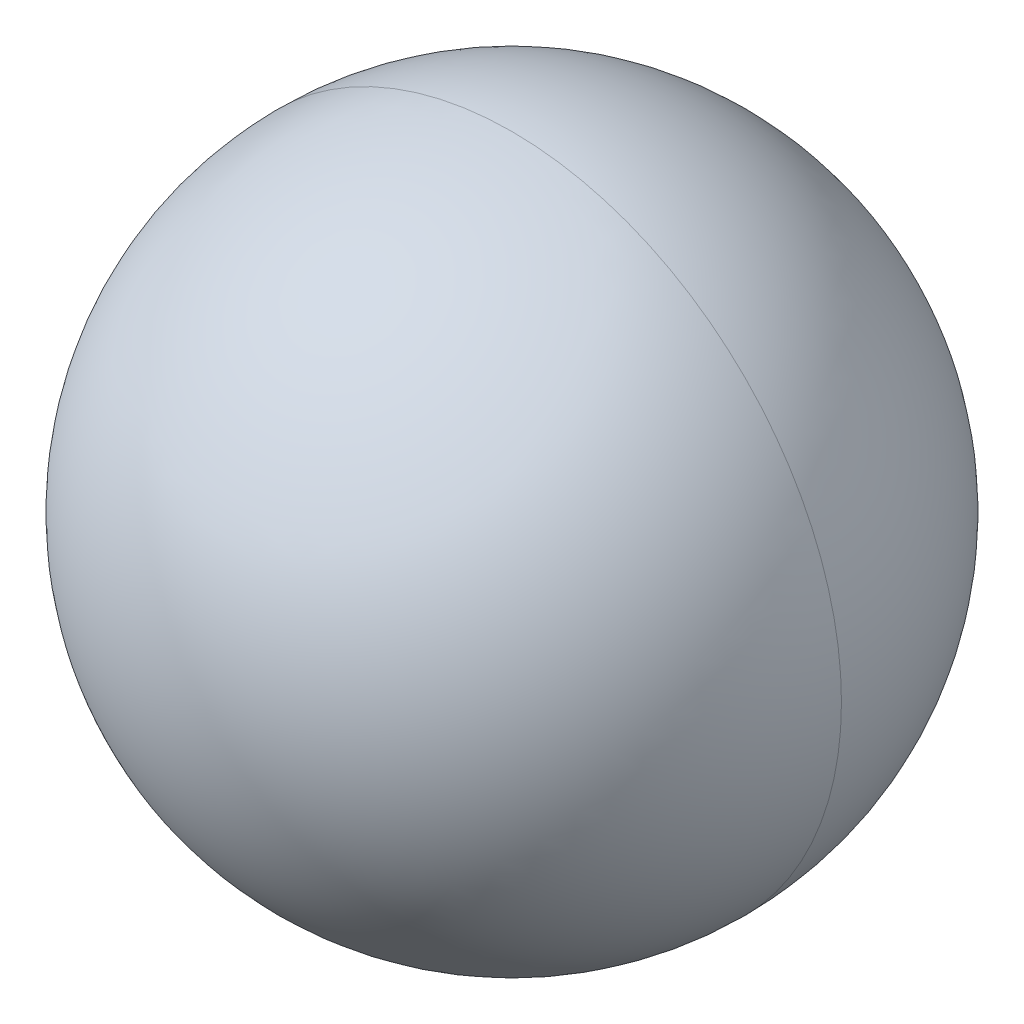
ISO-10303-21;
HEADER;
FILE_DESCRIPTION(('STEP AP214'),'2;1');
FILE_NAME('part.step','',(''),(''),'','','');
FILE_SCHEMA(('AUTOMOTIVE_DESIGN { 1 0 10303 214 1 1 1 1 }'));
ENDSEC;
DATA;
#1=APPLICATION_CONTEXT('core data for automotive mechanical design processes');
#2=APPLICATION_PROTOCOL_DEFINITION('international standard','automotive_design',2000,#1);
#3=PRODUCT_CONTEXT('',#1,'mechanical');
#4=PRODUCT('Part','Part','',(#3));
#5=PRODUCT_RELATED_PRODUCT_CATEGORY('part','',(#4));
#6=PRODUCT_DEFINITION_FORMATION('','',#4);
#7=PRODUCT_DEFINITION_CONTEXT('part definition',#1,'design');
#8=PRODUCT_DEFINITION('design','',#6,#7);
#9=PRODUCT_DEFINITION_SHAPE('','',#8);
#10=(LENGTH_UNIT() NAMED_UNIT(*) SI_UNIT(.MILLI.,.METRE.));
#11=(NAMED_UNIT(*) PLANE_ANGLE_UNIT() SI_UNIT($,.RADIAN.));
#12=(NAMED_UNIT(*) SI_UNIT($,.STERADIAN.) SOLID_ANGLE_UNIT());
#13=UNCERTAINTY_MEASURE_WITH_UNIT(LENGTH_MEASURE(1.E-05),#10,'distance_accuracy_value','');
#14=(GEOMETRIC_REPRESENTATION_CONTEXT(3) GLOBAL_UNCERTAINTY_ASSIGNED_CONTEXT((#13)) GLOBAL_UNIT_ASSIGNED_CONTEXT((#10,
#11,#12)) REPRESENTATION_CONTEXT('',''));
#15=CARTESIAN_POINT('',(0.,0.,0.));
#16=DIRECTION('',(0.,0.,1.));
#17=DIRECTION('',(1.,0.,0.));
#18=AXIS2_PLACEMENT_3D('',#15,#16,#17);
#19=CARTESIAN_POINT('',(0.2,-0.2,0.135));
#20=DIRECTION('',(0.,0.,-1.));
#21=DIRECTION('',(1.,0.,0.));
#22=AXIS2_PLACEMENT_3D('',#19,#20,#21);
#23=SPHERICAL_SURFACE('',#22,0.135);
#24=CARTESIAN_POINT('',(0.2,-0.2,0.135));
#25=DIRECTION('',(0.,0.,1.));
#26=DIRECTION('',(1.,0.,0.));
#27=AXIS2_PLACEMENT_3D('',#24,#25,#26);
#28=CIRCLE('',#27,0.135);
#29=CARTESIAN_POINT('',(0.335,-0.2,0.135));
#30=VERTEX_POINT('',#29);
#31=CARTESIAN_POINT('',(0.2,-0.065,0.135));
#32=VERTEX_POINT('',#31);
#33=EDGE_CURVE('E11',#30,#32,#28,.T.);
#34=ORIENTED_EDGE('',*,*,#33,.F.);
#35=CARTESIAN_POINT('',(0.335,-0.2,0.135));
#36=CARTESIAN_POINT('',(0.334999999999999,-0.199999999999999,0.0925884991765377));
#37=CARTESIAN_POINT('',(0.318392974453827,-0.200000000000001,0.0501374281460087));
#38=CARTESIAN_POINT('',(0.284862571853991,-0.2,0.0166070255461743));
#39=CARTESIAN_POINT('',(0.242411500823463,-0.2,0.));
#40=CARTESIAN_POINT('',(0.2,-0.2,0.));
#41=B_SPLINE_CURVE_WITH_KNOTS('',5,(#35,#36,#37,#38,#39,#40),.UNSPECIFIED.,.F.,.F.,(6,6),(0.,
1.5707963267949),.UNSPECIFIED.);
#42=CARTESIAN_POINT('',(0.2,-0.2,0.));
#43=VERTEX_POINT('',#42);
#44=EDGE_CURVE('E24',#30,#43,#41,.T.);
#45=ORIENTED_EDGE('',*,*,#44,.T.);
#46=ORIENTED_EDGE('',*,*,#44,.F.);
#47=CARTESIAN_POINT('',(0.2,-0.335,0.135));
#48=VERTEX_POINT('',#47);
#49=EDGE_CURVE('E25',#48,#30,#28,.T.);
#50=ORIENTED_EDGE('',*,*,#49,.F.);
#51=CARTESIAN_POINT('',(0.2,-0.2,0.135));
#52=DIRECTION('',(0.,0.,-1.));
#53=DIRECTION('',(-1.,0.,0.));
#54=AXIS2_PLACEMENT_3D('',#51,#52,#53);
#55=CIRCLE('',#54,0.135);
#56=EDGE_CURVE('E46',#48,#32,#55,.T.);
#57=ORIENTED_EDGE('',*,*,#56,.T.);
#58=EDGE_LOOP('',(#34,#45,#46,#50,#57));
#59=FACE_BOUND('',#58,.T.);
#60=ADVANCED_FACE('F17',(#59),#23,.T.);
#61=CARTESIAN_POINT('',(0.2,-0.2,0.135));
#62=DIRECTION('',(0.,0.,-1.));
#63=DIRECTION('',(1.,0.,0.));
#64=AXIS2_PLACEMENT_3D('',#61,#62,#63);
#65=SPHERICAL_SURFACE('',#64,0.135);
#66=ORIENTED_EDGE('',*,*,#56,.F.);
#67=ORIENTED_EDGE('',*,*,#49,.T.);
#68=CARTESIAN_POINT('',(0.2,-0.2,0.27));
#69=CARTESIAN_POINT('',(0.242411500823463,-0.200000000000001,0.270000000000001));
#70=CARTESIAN_POINT('',(0.28486257185399,-0.199999999999999,0.253392974453824));
#71=CARTESIAN_POINT('',(0.318392974453827,-0.200000000000001,0.219862571853992));
#72=CARTESIAN_POINT('',(0.335,-0.2,0.177411500823462));
#73=CARTESIAN_POINT('',(0.335,-0.2,0.135));
#74=B_SPLINE_CURVE_WITH_KNOTS('',5,(#68,#69,#70,#71,#72,#73),.UNSPECIFIED.,.F.,.F.,(6,6),
(-1.5707963267949,0.),.UNSPECIFIED.);
#75=CARTESIAN_POINT('',(0.2,-0.2,0.27));
#76=VERTEX_POINT('',#75);
#77=EDGE_CURVE('E44',#76,#30,#74,.T.);
#78=ORIENTED_EDGE('',*,*,#77,.F.);
#79=ORIENTED_EDGE('',*,*,#77,.T.);
#80=ORIENTED_EDGE('',*,*,#33,.T.);
#81=EDGE_LOOP('',(#66,#67,#78,#79,#80));
#82=FACE_BOUND('',#81,.T.);
#83=ADVANCED_FACE('F45',(#82),#65,.T.);
#84=CLOSED_SHELL('',(#60,#83));
#85=MANIFOLD_SOLID_BREP('B1',#84);
#86=ADVANCED_BREP_SHAPE_REPRESENTATION('',(#18,#85),#14);
#87=SHAPE_DEFINITION_REPRESENTATION(#9,#86);
ENDSEC;
END-ISO-10303-21;
